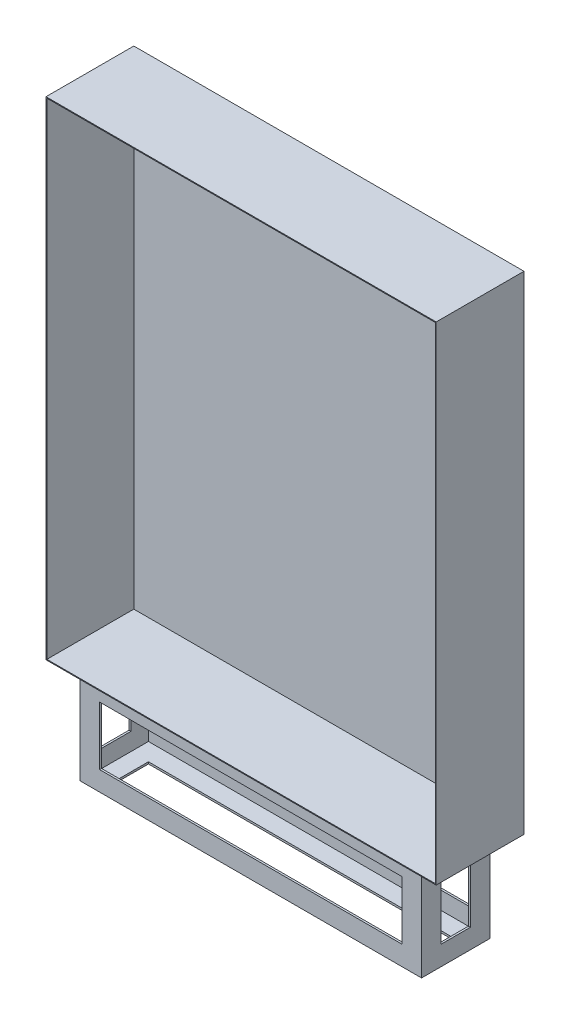
ISO-10303-21;
HEADER;
FILE_DESCRIPTION(('STEP AP214'),'2;1');
FILE_NAME('part.step','',(''),(''),'','','');
FILE_SCHEMA(('AUTOMOTIVE_DESIGN { 1 0 10303 214 1 1 1 1 }'));
ENDSEC;
DATA;
#1=APPLICATION_CONTEXT('core data for automotive mechanical design processes');
#2=APPLICATION_PROTOCOL_DEFINITION('international standard','automotive_design',2000,#1);
#3=PRODUCT_CONTEXT('',#1,'mechanical');
#4=PRODUCT('Part','Part','',(#3));
#5=PRODUCT_RELATED_PRODUCT_CATEGORY('part','',(#4));
#6=PRODUCT_DEFINITION_FORMATION('','',#4);
#7=PRODUCT_DEFINITION_CONTEXT('part definition',#1,'design');
#8=PRODUCT_DEFINITION('design','',#6,#7);
#9=PRODUCT_DEFINITION_SHAPE('','',#8);
#10=(LENGTH_UNIT() NAMED_UNIT(*) SI_UNIT(.MILLI.,.METRE.));
#11=(NAMED_UNIT(*) PLANE_ANGLE_UNIT() SI_UNIT($,.RADIAN.));
#12=(NAMED_UNIT(*) SI_UNIT($,.STERADIAN.) SOLID_ANGLE_UNIT());
#13=UNCERTAINTY_MEASURE_WITH_UNIT(LENGTH_MEASURE(1.E-05),#10,'distance_accuracy_value','');
#14=(GEOMETRIC_REPRESENTATION_CONTEXT(3) GLOBAL_UNCERTAINTY_ASSIGNED_CONTEXT((#13)) GLOBAL_UNIT_ASSIGNED_CONTEXT((#10,
#11,#12)) REPRESENTATION_CONTEXT('',''));
#15=CARTESIAN_POINT('',(0.,0.,0.));
#16=DIRECTION('',(0.,0.,1.));
#17=DIRECTION('',(1.,0.,0.));
#18=AXIS2_PLACEMENT_3D('',#15,#16,#17);
#19=CARTESIAN_POINT('',(0.,0.,180.));
#20=DIRECTION('',(0.,1.,0.));
#21=DIRECTION('',(0.,0.,1.));
#22=AXIS2_PLACEMENT_3D('',#19,#20,#21);
#23=PLANE('',#22);
#24=DIRECTION('',(1.,0.,0.));
#25=VECTOR('',#24,1.);
#26=CARTESIAN_POINT('',(0.,0.,0.));
#27=LINE('',#26,#25);
#28=CARTESIAN_POINT('',(0.,0.,0.));
#29=VERTEX_POINT('',#28);
#30=CARTESIAN_POINT('',(800.,0.,0.));
#31=VERTEX_POINT('',#30);
#32=EDGE_CURVE('E493',#29,#31,#27,.T.);
#33=ORIENTED_EDGE('',*,*,#32,.T.);
#34=DIRECTION('',(0.,0.,-1.));
#35=VECTOR('',#34,1.);
#36=CARTESIAN_POINT('',(800.,0.,180.));
#37=LINE('',#36,#35);
#38=CARTESIAN_POINT('',(800.,0.,180.));
#39=VERTEX_POINT('',#38);
#40=EDGE_CURVE('E503',#39,#31,#37,.T.);
#41=ORIENTED_EDGE('',*,*,#40,.F.);
#42=DIRECTION('',(1.,0.,0.));
#43=VECTOR('',#42,1.);
#44=CARTESIAN_POINT('',(0.,0.,180.));
#45=LINE('',#44,#43);
#46=CARTESIAN_POINT('',(0.,0.,180.));
#47=VERTEX_POINT('',#46);
#48=EDGE_CURVE('E483',#47,#39,#45,.T.);
#49=ORIENTED_EDGE('',*,*,#48,.F.);
#50=DIRECTION('',(0.,0.,-1.));
#51=VECTOR('',#50,1.);
#52=CARTESIAN_POINT('',(0.,0.,180.));
#53=LINE('',#52,#51);
#54=EDGE_CURVE('E506',#47,#29,#53,.T.);
#55=ORIENTED_EDGE('',*,*,#54,.T.);
#56=EDGE_LOOP('',(#33,#41,#49,#55));
#57=FACE_BOUND('',#56,.T.);
#58=DIRECTION('',(0.,0.,-1.));
#59=VECTOR('',#58,1.);
#60=CARTESIAN_POINT('',(50.,0.,160.));
#61=LINE('',#60,#59);
#62=CARTESIAN_POINT('',(50.,0.,160.));
#63=VERTEX_POINT('',#62);
#64=CARTESIAN_POINT('',(50.,0.,20.));
#65=VERTEX_POINT('',#64);
#66=EDGE_CURVE('E420',#63,#65,#61,.T.);
#67=ORIENTED_EDGE('',*,*,#66,.F.);
#68=DIRECTION('',(-1.,0.,0.));
#69=VECTOR('',#68,1.);
#70=CARTESIAN_POINT('',(50.,0.,160.));
#71=LINE('',#70,#69);
#72=CARTESIAN_POINT('',(750.,0.,160.));
#73=VERTEX_POINT('',#72);
#74=EDGE_CURVE('E425',#73,#63,#71,.T.);
#75=ORIENTED_EDGE('',*,*,#74,.F.);
#76=DIRECTION('',(0.,0.,1.));
#77=VECTOR('',#76,1.);
#78=CARTESIAN_POINT('',(750.,0.,160.));
#79=LINE('',#78,#77);
#80=CARTESIAN_POINT('',(750.,0.,20.));
#81=VERTEX_POINT('',#80);
#82=EDGE_CURVE('E437',#81,#73,#79,.T.);
#83=ORIENTED_EDGE('',*,*,#82,.F.);
#84=DIRECTION('',(1.,0.,0.));
#85=VECTOR('',#84,1.);
#86=CARTESIAN_POINT('',(50.,0.,20.));
#87=LINE('',#86,#85);
#88=EDGE_CURVE('E434',#65,#81,#87,.T.);
#89=ORIENTED_EDGE('',*,*,#88,.F.);
#90=EDGE_LOOP('',(#67,#75,#83,#89));
#91=FACE_BOUND('',#90,.T.);
#92=ADVANCED_FACE('F34',(#57,#91),#23,.F.);
#93=CARTESIAN_POINT('',(0.,0.,180.));
#94=DIRECTION('',(0.,0.,-1.));
#95=DIRECTION('',(-1.,0.,0.));
#96=AXIS2_PLACEMENT_3D('',#93,#94,#95);
#97=PLANE('',#96);
#98=DIRECTION('',(0.,-1.,0.));
#99=VECTOR('',#98,1.);
#100=CARTESIAN_POINT('',(0.,0.,180.));
#101=LINE('',#100,#99);
#102=CARTESIAN_POINT('',(0.,1000.,180.));
#103=VERTEX_POINT('',#102);
#104=EDGE_CURVE('E480',#103,#47,#101,.T.);
#105=ORIENTED_EDGE('',*,*,#104,.T.);
#106=ORIENTED_EDGE('',*,*,#48,.T.);
#107=DIRECTION('',(0.,1.,0.));
#108=VECTOR('',#107,1.);
#109=CARTESIAN_POINT('',(800.,0.,180.));
#110=LINE('',#109,#108);
#111=CARTESIAN_POINT('',(800.,1000.,180.));
#112=VERTEX_POINT('',#111);
#113=EDGE_CURVE('E486',#39,#112,#110,.T.);
#114=ORIENTED_EDGE('',*,*,#113,.T.);
#115=DIRECTION('',(-1.,0.,0.));
#116=VECTOR('',#115,1.);
#117=CARTESIAN_POINT('',(0.,1000.,180.));
#118=LINE('',#117,#116);
#119=EDGE_CURVE('E488',#112,#103,#118,.T.);
#120=ORIENTED_EDGE('',*,*,#119,.T.);
#121=EDGE_LOOP('',(#105,#106,#114,#120));
#122=FACE_BOUND('',#121,.T.);
#123=DIRECTION('',(0.,-1.,0.));
#124=VECTOR('',#123,1.);
#125=CARTESIAN_POINT('',(1.8,0.,180.));
#126=LINE('',#125,#124);
#127=CARTESIAN_POINT('',(1.8,998.2,180.));
#128=VERTEX_POINT('',#127);
#129=CARTESIAN_POINT('',(1.8,1.8,180.));
#130=VERTEX_POINT('',#129);
#131=EDGE_CURVE('E472',#128,#130,#126,.T.);
#132=ORIENTED_EDGE('',*,*,#131,.F.);
#133=DIRECTION('',(-1.,0.,0.));
#134=VECTOR('',#133,1.);
#135=CARTESIAN_POINT('',(0.,998.2,180.));
#136=LINE('',#135,#134);
#137=CARTESIAN_POINT('',(798.2,998.2,180.));
#138=VERTEX_POINT('',#137);
#139=EDGE_CURVE('E462',#138,#128,#136,.T.);
#140=ORIENTED_EDGE('',*,*,#139,.F.);
#141=DIRECTION('',(0.,1.,0.));
#142=VECTOR('',#141,1.);
#143=CARTESIAN_POINT('',(798.2,0.,180.));
#144=LINE('',#143,#142);
#145=CARTESIAN_POINT('',(798.2,1.8,180.));
#146=VERTEX_POINT('',#145);
#147=EDGE_CURVE('E476',#146,#138,#144,.T.);
#148=ORIENTED_EDGE('',*,*,#147,.F.);
#149=DIRECTION('',(1.,0.,0.));
#150=VECTOR('',#149,1.);
#151=CARTESIAN_POINT('',(0.,1.8,180.));
#152=LINE('',#151,#150);
#153=EDGE_CURVE('E474',#130,#146,#152,.T.);
#154=ORIENTED_EDGE('',*,*,#153,.F.);
#155=EDGE_LOOP('',(#132,#140,#148,#154));
#156=FACE_BOUND('',#155,.T.);
#157=ADVANCED_FACE('F604',(#122,#156),#97,.F.);
#158=CARTESIAN_POINT('',(0.,0.,180.));
#159=DIRECTION('',(1.,0.,0.));
#160=DIRECTION('',(0.,0.,-1.));
#161=AXIS2_PLACEMENT_3D('',#158,#159,#160);
#162=PLANE('',#161);
#163=DIRECTION('',(0.,-1.,0.));
#164=VECTOR('',#163,1.);
#165=CARTESIAN_POINT('',(0.,0.,0.));
#166=LINE('',#165,#164);
#167=CARTESIAN_POINT('',(0.,1000.,0.));
#168=VERTEX_POINT('',#167);
#169=EDGE_CURVE('E456',#168,#29,#166,.T.);
#170=ORIENTED_EDGE('',*,*,#169,.T.);
#171=ORIENTED_EDGE('',*,*,#54,.F.);
#172=ORIENTED_EDGE('',*,*,#104,.F.);
#173=DIRECTION('',(0.,0.,-1.));
#174=VECTOR('',#173,1.);
#175=CARTESIAN_POINT('',(0.,1000.,180.));
#176=LINE('',#175,#174);
#177=EDGE_CURVE('E490',#103,#168,#176,.T.);
#178=ORIENTED_EDGE('',*,*,#177,.T.);
#179=EDGE_LOOP('',(#170,#171,#172,#178));
#180=FACE_BOUND('',#179,.T.);
#181=ADVANCED_FACE('F36',(#180),#162,.F.);
#182=CARTESIAN_POINT('',(800.,0.,180.));
#183=DIRECTION('',(-1.,0.,0.));
#184=DIRECTION('',(0.,0.,1.));
#185=AXIS2_PLACEMENT_3D('',#182,#183,#184);
#186=PLANE('',#185);
#187=DIRECTION('',(0.,1.,0.));
#188=VECTOR('',#187,1.);
#189=CARTESIAN_POINT('',(800.,0.,0.));
#190=LINE('',#189,#188);
#191=CARTESIAN_POINT('',(800.,1000.,0.));
#192=VERTEX_POINT('',#191);
#193=EDGE_CURVE('E495',#31,#192,#190,.T.);
#194=ORIENTED_EDGE('',*,*,#193,.T.);
#195=DIRECTION('',(0.,0.,-1.));
#196=VECTOR('',#195,1.);
#197=CARTESIAN_POINT('',(800.,1000.,180.));
#198=LINE('',#197,#196);
#199=EDGE_CURVE('E500',#112,#192,#198,.T.);
#200=ORIENTED_EDGE('',*,*,#199,.F.);
#201=ORIENTED_EDGE('',*,*,#113,.F.);
#202=ORIENTED_EDGE('',*,*,#40,.T.);
#203=EDGE_LOOP('',(#194,#200,#201,#202));
#204=FACE_BOUND('',#203,.T.);
#205=ADVANCED_FACE('F683',(#204),#186,.F.);
#206=CARTESIAN_POINT('',(0.,1000.,180.));
#207=DIRECTION('',(0.,-1.,0.));
#208=DIRECTION('',(0.,0.,-1.));
#209=AXIS2_PLACEMENT_3D('',#206,#207,#208);
#210=PLANE('',#209);
#211=DIRECTION('',(-1.,0.,0.));
#212=VECTOR('',#211,1.);
#213=CARTESIAN_POINT('',(0.,1000.,0.));
#214=LINE('',#213,#212);
#215=EDGE_CURVE('E484',#192,#168,#214,.T.);
#216=ORIENTED_EDGE('',*,*,#215,.T.);
#217=ORIENTED_EDGE('',*,*,#177,.F.);
#218=ORIENTED_EDGE('',*,*,#119,.F.);
#219=ORIENTED_EDGE('',*,*,#199,.T.);
#220=EDGE_LOOP('',(#216,#217,#218,#219));
#221=FACE_BOUND('',#220,.T.);
#222=ADVANCED_FACE('F680',(#221),#210,.F.);
#223=CARTESIAN_POINT('',(0.,0.,0.));
#224=DIRECTION('',(0.,0.,-1.));
#225=DIRECTION('',(-1.,0.,0.));
#226=AXIS2_PLACEMENT_3D('',#223,#224,#225);
#227=PLANE('',#226);
#228=ORIENTED_EDGE('',*,*,#169,.F.);
#229=ORIENTED_EDGE('',*,*,#215,.F.);
#230=ORIENTED_EDGE('',*,*,#193,.F.);
#231=ORIENTED_EDGE('',*,*,#32,.F.);
#232=EDGE_LOOP('',(#228,#229,#230,#231));
#233=FACE_BOUND('',#232,.T.);
#234=ADVANCED_FACE('F662',(#233),#227,.T.);
#235=CARTESIAN_POINT('',(1.8,0.,180.));
#236=DIRECTION('',(1.,0.,0.));
#237=DIRECTION('',(0.,0.,-1.));
#238=AXIS2_PLACEMENT_3D('',#235,#236,#237);
#239=PLANE('',#238);
#240=DIRECTION('',(0.,-1.,0.));
#241=VECTOR('',#240,1.);
#242=CARTESIAN_POINT('',(1.8,0.,1.8));
#243=LINE('',#242,#241);
#244=CARTESIAN_POINT('',(1.8,998.2,1.8));
#245=VERTEX_POINT('',#244);
#246=CARTESIAN_POINT('',(1.8,1.8,1.8));
#247=VERTEX_POINT('',#246);
#248=EDGE_CURVE('E449',#245,#247,#243,.T.);
#249=ORIENTED_EDGE('',*,*,#248,.F.);
#250=DIRECTION('',(0.,0.,-1.));
#251=VECTOR('',#250,1.);
#252=CARTESIAN_POINT('',(1.8,998.2,180.));
#253=LINE('',#252,#251);
#254=EDGE_CURVE('E458',#128,#245,#253,.T.);
#255=ORIENTED_EDGE('',*,*,#254,.F.);
#256=ORIENTED_EDGE('',*,*,#131,.T.);
#257=DIRECTION('',(0.,0.,-1.));
#258=VECTOR('',#257,1.);
#259=CARTESIAN_POINT('',(1.8,1.8,180.));
#260=LINE('',#259,#258);
#261=EDGE_CURVE('E453',#130,#247,#260,.T.);
#262=ORIENTED_EDGE('',*,*,#261,.T.);
#263=EDGE_LOOP('',(#249,#255,#256,#262));
#264=FACE_BOUND('',#263,.T.);
#265=ADVANCED_FACE('F658',(#264),#239,.T.);
#266=CARTESIAN_POINT('',(0.,1.8,180.));
#267=DIRECTION('',(0.,1.,0.));
#268=DIRECTION('',(0.,0.,1.));
#269=AXIS2_PLACEMENT_3D('',#266,#267,#268);
#270=PLANE('',#269);
#271=DIRECTION('',(1.,0.,0.));
#272=VECTOR('',#271,1.);
#273=CARTESIAN_POINT('',(0.,1.8,1.8));
#274=LINE('',#273,#272);
#275=CARTESIAN_POINT('',(798.2,1.8,1.8));
#276=VERTEX_POINT('',#275);
#277=EDGE_CURVE('E452',#247,#276,#274,.T.);
#278=ORIENTED_EDGE('',*,*,#277,.F.);
#279=ORIENTED_EDGE('',*,*,#261,.F.);
#280=ORIENTED_EDGE('',*,*,#153,.T.);
#281=DIRECTION('',(0.,0.,-1.));
#282=VECTOR('',#281,1.);
#283=CARTESIAN_POINT('',(798.2,1.8,180.));
#284=LINE('',#283,#282);
#285=EDGE_CURVE('E457',#146,#276,#284,.T.);
#286=ORIENTED_EDGE('',*,*,#285,.T.);
#287=EDGE_LOOP('',(#278,#279,#280,#286));
#288=FACE_BOUND('',#287,.T.);
#289=ADVANCED_FACE('F661',(#288),#270,.T.);
#290=CARTESIAN_POINT('',(798.2,0.,180.));
#291=DIRECTION('',(-1.,0.,0.));
#292=DIRECTION('',(0.,0.,1.));
#293=AXIS2_PLACEMENT_3D('',#290,#291,#292);
#294=PLANE('',#293);
#295=DIRECTION('',(0.,1.,0.));
#296=VECTOR('',#295,1.);
#297=CARTESIAN_POINT('',(798.2,0.,1.8));
#298=LINE('',#297,#296);
#299=CARTESIAN_POINT('',(798.2,998.2,1.8));
#300=VERTEX_POINT('',#299);
#301=EDGE_CURVE('E464',#276,#300,#298,.T.);
#302=ORIENTED_EDGE('',*,*,#301,.F.);
#303=ORIENTED_EDGE('',*,*,#285,.F.);
#304=ORIENTED_EDGE('',*,*,#147,.T.);
#305=DIRECTION('',(0.,0.,-1.));
#306=VECTOR('',#305,1.);
#307=CARTESIAN_POINT('',(798.2,998.2,180.));
#308=LINE('',#307,#306);
#309=EDGE_CURVE('E461',#138,#300,#308,.T.);
#310=ORIENTED_EDGE('',*,*,#309,.T.);
#311=EDGE_LOOP('',(#302,#303,#304,#310));
#312=FACE_BOUND('',#311,.T.);
#313=ADVANCED_FACE('F666',(#312),#294,.T.);
#314=CARTESIAN_POINT('',(0.,998.2,180.));
#315=DIRECTION('',(0.,-1.,0.));
#316=DIRECTION('',(0.,0.,-1.));
#317=AXIS2_PLACEMENT_3D('',#314,#315,#316);
#318=PLANE('',#317);
#319=DIRECTION('',(-1.,0.,0.));
#320=VECTOR('',#319,1.);
#321=CARTESIAN_POINT('',(0.,998.2,1.8));
#322=LINE('',#321,#320);
#323=EDGE_CURVE('E468',#300,#245,#322,.T.);
#324=ORIENTED_EDGE('',*,*,#323,.F.);
#325=ORIENTED_EDGE('',*,*,#309,.F.);
#326=ORIENTED_EDGE('',*,*,#139,.T.);
#327=ORIENTED_EDGE('',*,*,#254,.T.);
#328=EDGE_LOOP('',(#324,#325,#326,#327));
#329=FACE_BOUND('',#328,.T.);
#330=ADVANCED_FACE('F670',(#329),#318,.T.);
#331=CARTESIAN_POINT('',(0.,0.,1.8));
#332=DIRECTION('',(0.,0.,-1.));
#333=DIRECTION('',(-1.,0.,0.));
#334=AXIS2_PLACEMENT_3D('',#331,#332,#333);
#335=PLANE('',#334);
#336=ORIENTED_EDGE('',*,*,#248,.T.);
#337=ORIENTED_EDGE('',*,*,#277,.T.);
#338=ORIENTED_EDGE('',*,*,#301,.T.);
#339=ORIENTED_EDGE('',*,*,#323,.T.);
#340=EDGE_LOOP('',(#336,#337,#338,#339));
#341=FACE_BOUND('',#340,.T.);
#342=ADVANCED_FACE('F574',(#341),#335,.F.);
#343=CARTESIAN_POINT('',(0.,-200.,0.));
#344=DIRECTION('',(0.,-1.,0.));
#345=DIRECTION('',(0.,0.,-1.));
#346=AXIS2_PLACEMENT_3D('',#343,#344,#345);
#347=PLANE('',#346);
#348=DIRECTION('',(0.,0.,-1.));
#349=VECTOR('',#348,1.);
#350=CARTESIAN_POINT('',(50.,-200.,160.));
#351=LINE('',#350,#349);
#352=CARTESIAN_POINT('',(50.,-200.,160.));
#353=VERTEX_POINT('',#352);
#354=CARTESIAN_POINT('',(50.,-200.,20.));
#355=VERTEX_POINT('',#354);
#356=EDGE_CURVE('E421',#353,#355,#351,.T.);
#357=ORIENTED_EDGE('',*,*,#356,.T.);
#358=DIRECTION('',(1.,0.,0.));
#359=VECTOR('',#358,1.);
#360=CARTESIAN_POINT('',(50.,-200.,20.));
#361=LINE('',#360,#359);
#362=CARTESIAN_POINT('',(750.,-200.,20.));
#363=VERTEX_POINT('',#362);
#364=EDGE_CURVE('E424',#355,#363,#361,.T.);
#365=ORIENTED_EDGE('',*,*,#364,.T.);
#366=DIRECTION('',(0.,0.,1.));
#367=VECTOR('',#366,1.);
#368=CARTESIAN_POINT('',(750.,-200.,160.));
#369=LINE('',#368,#367);
#370=CARTESIAN_POINT('',(750.,-200.,160.));
#371=VERTEX_POINT('',#370);
#372=EDGE_CURVE('E427',#363,#371,#369,.T.);
#373=ORIENTED_EDGE('',*,*,#372,.T.);
#374=DIRECTION('',(-1.,0.,0.));
#375=VECTOR('',#374,1.);
#376=CARTESIAN_POINT('',(50.,-200.,160.));
#377=LINE('',#376,#375);
#378=EDGE_CURVE('E429',#371,#353,#377,.T.);
#379=ORIENTED_EDGE('',*,*,#378,.T.);
#380=EDGE_LOOP('',(#357,#365,#373,#379));
#381=FACE_BOUND('',#380,.T.);
#382=DIRECTION('',(-1.,0.,0.));
#383=VECTOR('',#382,1.);
#384=CARTESIAN_POINT('',(710.,-200.,120.));
#385=LINE('',#384,#383);
#386=CARTESIAN_POINT('',(710.,-200.,120.));
#387=VERTEX_POINT('',#386);
#388=CARTESIAN_POINT('',(90.,-200.,120.));
#389=VERTEX_POINT('',#388);
#390=EDGE_CURVE('E359',#387,#389,#385,.T.);
#391=ORIENTED_EDGE('',*,*,#390,.F.);
#392=DIRECTION('',(0.,0.,1.));
#393=VECTOR('',#392,1.);
#394=CARTESIAN_POINT('',(710.,-200.,60.));
#395=LINE('',#394,#393);
#396=CARTESIAN_POINT('',(710.,-200.,60.));
#397=VERTEX_POINT('',#396);
#398=EDGE_CURVE('E364',#397,#387,#395,.T.);
#399=ORIENTED_EDGE('',*,*,#398,.F.);
#400=DIRECTION('',(1.,0.,0.));
#401=VECTOR('',#400,1.);
#402=CARTESIAN_POINT('',(90.,-200.,60.));
#403=LINE('',#402,#401);
#404=CARTESIAN_POINT('',(90.,-200.,60.));
#405=VERTEX_POINT('',#404);
#406=EDGE_CURVE('E378',#405,#397,#403,.T.);
#407=ORIENTED_EDGE('',*,*,#406,.F.);
#408=DIRECTION('',(0.,0.,-1.));
#409=VECTOR('',#408,1.);
#410=CARTESIAN_POINT('',(90.,-200.,120.));
#411=LINE('',#410,#409);
#412=EDGE_CURVE('E375',#389,#405,#411,.T.);
#413=ORIENTED_EDGE('',*,*,#412,.F.);
#414=EDGE_LOOP('',(#391,#399,#407,#413));
#415=FACE_BOUND('',#414,.T.);
#416=ADVANCED_FACE('F554',(#381,#415),#347,.T.);
#417=CARTESIAN_POINT('',(50.,-200.,160.));
#418=DIRECTION('',(1.,0.,0.));
#419=DIRECTION('',(0.,0.,-1.));
#420=AXIS2_PLACEMENT_3D('',#417,#418,#419);
#421=PLANE('',#420);
#422=DIRECTION('',(0.,1.,0.));
#423=VECTOR('',#422,1.);
#424=CARTESIAN_POINT('',(50.,-40.,120.));
#425=LINE('',#424,#423);
#426=CARTESIAN_POINT('',(50.,-160.,120.));
#427=VERTEX_POINT('',#426);
#428=CARTESIAN_POINT('',(50.,-40.,120.));
#429=VERTEX_POINT('',#428);
#430=EDGE_CURVE('E546',#427,#429,#425,.T.);
#431=ORIENTED_EDGE('',*,*,#430,.F.);
#432=DIRECTION('',(0.,0.,1.));
#433=VECTOR('',#432,1.);
#434=CARTESIAN_POINT('',(50.,-160.,120.));
#435=LINE('',#434,#433);
#436=CARTESIAN_POINT('',(50.,-160.,60.));
#437=VERTEX_POINT('',#436);
#438=EDGE_CURVE('E308',#437,#427,#435,.T.);
#439=ORIENTED_EDGE('',*,*,#438,.F.);
#440=DIRECTION('',(0.,-1.,0.));
#441=VECTOR('',#440,1.);
#442=CARTESIAN_POINT('',(50.,-160.,60.));
#443=LINE('',#442,#441);
#444=CARTESIAN_POINT('',(50.,-40.,60.));
#445=VERTEX_POINT('',#444);
#446=EDGE_CURVE('E305',#445,#437,#443,.T.);
#447=ORIENTED_EDGE('',*,*,#446,.F.);
#448=DIRECTION('',(0.,0.,-1.));
#449=VECTOR('',#448,1.);
#450=CARTESIAN_POINT('',(50.,-40.,60.));
#451=LINE('',#450,#449);
#452=EDGE_CURVE('E298',#429,#445,#451,.T.);
#453=ORIENTED_EDGE('',*,*,#452,.F.);
#454=EDGE_LOOP('',(#431,#439,#447,#453));
#455=FACE_BOUND('',#454,.T.);
#456=DIRECTION('',(0.,1.,0.));
#457=VECTOR('',#456,1.);
#458=CARTESIAN_POINT('',(50.,-200.,160.));
#459=LINE('',#458,#457);
#460=EDGE_CURVE('E431',#353,#63,#459,.T.);
#461=ORIENTED_EDGE('',*,*,#460,.T.);
#462=ORIENTED_EDGE('',*,*,#66,.T.);
#463=DIRECTION('',(0.,1.,0.));
#464=VECTOR('',#463,1.);
#465=CARTESIAN_POINT('',(50.,-200.,20.));
#466=LINE('',#465,#464);
#467=EDGE_CURVE('E447',#355,#65,#466,.T.);
#468=ORIENTED_EDGE('',*,*,#467,.F.);
#469=ORIENTED_EDGE('',*,*,#356,.F.);
#470=EDGE_LOOP('',(#461,#462,#468,#469));
#471=FACE_BOUND('',#470,.T.);
#472=ADVANCED_FACE('F548',(#455,#471),#421,.F.);
#473=CARTESIAN_POINT('',(50.,-200.,20.));
#474=DIRECTION('',(0.,0.,1.));
#475=DIRECTION('',(1.,0.,0.));
#476=AXIS2_PLACEMENT_3D('',#473,#474,#475);
#477=PLANE('',#476);
#478=DIRECTION('',(0.,1.,0.));
#479=VECTOR('',#478,1.);
#480=CARTESIAN_POINT('',(90.,-160.,20.));
#481=LINE('',#480,#479);
#482=CARTESIAN_POINT('',(90.,-160.,20.));
#483=VERTEX_POINT('',#482);
#484=CARTESIAN_POINT('',(90.,-40.,20.));
#485=VERTEX_POINT('',#484);
#486=EDGE_CURVE('E326',#483,#485,#481,.T.);
#487=ORIENTED_EDGE('',*,*,#486,.F.);
#488=DIRECTION('',(-1.,0.,0.));
#489=VECTOR('',#488,1.);
#490=CARTESIAN_POINT('',(710.,-160.,20.));
#491=LINE('',#490,#489);
#492=CARTESIAN_POINT('',(710.,-160.,20.));
#493=VERTEX_POINT('',#492);
#494=EDGE_CURVE('E315',#493,#483,#491,.T.);
#495=ORIENTED_EDGE('',*,*,#494,.F.);
#496=DIRECTION('',(0.,-1.,0.));
#497=VECTOR('',#496,1.);
#498=CARTESIAN_POINT('',(710.,-40.,20.));
#499=LINE('',#498,#497);
#500=CARTESIAN_POINT('',(710.,-40.,20.));
#501=VERTEX_POINT('',#500);
#502=EDGE_CURVE('E332',#501,#493,#499,.T.);
#503=ORIENTED_EDGE('',*,*,#502,.F.);
#504=DIRECTION('',(1.,0.,0.));
#505=VECTOR('',#504,1.);
#506=CARTESIAN_POINT('',(90.,-40.,20.));
#507=LINE('',#506,#505);
#508=EDGE_CURVE('E329',#485,#501,#507,.T.);
#509=ORIENTED_EDGE('',*,*,#508,.F.);
#510=EDGE_LOOP('',(#487,#495,#503,#509));
#511=FACE_BOUND('',#510,.T.);
#512=ORIENTED_EDGE('',*,*,#467,.T.);
#513=ORIENTED_EDGE('',*,*,#88,.T.);
#514=DIRECTION('',(0.,1.,0.));
#515=VECTOR('',#514,1.);
#516=CARTESIAN_POINT('',(750.,-200.,20.));
#517=LINE('',#516,#515);
#518=EDGE_CURVE('E445',#363,#81,#517,.T.);
#519=ORIENTED_EDGE('',*,*,#518,.F.);
#520=ORIENTED_EDGE('',*,*,#364,.F.);
#521=EDGE_LOOP('',(#512,#513,#519,#520));
#522=FACE_BOUND('',#521,.T.);
#523=ADVANCED_FACE('F553',(#511,#522),#477,.F.);
#524=CARTESIAN_POINT('',(750.,-200.,160.));
#525=DIRECTION('',(-1.,0.,0.));
#526=DIRECTION('',(0.,0.,1.));
#527=AXIS2_PLACEMENT_3D('',#524,#525,#526);
#528=PLANE('',#527);
#529=DIRECTION('',(0.,1.,0.));
#530=VECTOR('',#529,1.);
#531=CARTESIAN_POINT('',(750.,-160.,60.));
#532=LINE('',#531,#530);
#533=CARTESIAN_POINT('',(750.,-160.,60.));
#534=VERTEX_POINT('',#533);
#535=CARTESIAN_POINT('',(750.,-40.,60.));
#536=VERTEX_POINT('',#535);
#537=EDGE_CURVE('E282',#534,#536,#532,.T.);
#538=ORIENTED_EDGE('',*,*,#537,.F.);
#539=DIRECTION('',(0.,0.,-1.));
#540=VECTOR('',#539,1.);
#541=CARTESIAN_POINT('',(750.,-160.,120.));
#542=LINE('',#541,#540);
#543=CARTESIAN_POINT('',(750.,-160.,120.));
#544=VERTEX_POINT('',#543);
#545=EDGE_CURVE('E57',#544,#534,#542,.T.);
#546=ORIENTED_EDGE('',*,*,#545,.F.);
#547=DIRECTION('',(0.,-1.,0.));
#548=VECTOR('',#547,1.);
#549=CARTESIAN_POINT('',(750.,-40.,120.));
#550=LINE('',#549,#548);
#551=CARTESIAN_POINT('',(750.,-40.,120.));
#552=VERTEX_POINT('',#551);
#553=EDGE_CURVE('E290',#552,#544,#550,.T.);
#554=ORIENTED_EDGE('',*,*,#553,.F.);
#555=DIRECTION('',(0.,0.,1.));
#556=VECTOR('',#555,1.);
#557=CARTESIAN_POINT('',(750.,-40.,60.));
#558=LINE('',#557,#556);
#559=EDGE_CURVE('E273',#536,#552,#558,.T.);
#560=ORIENTED_EDGE('',*,*,#559,.F.);
#561=EDGE_LOOP('',(#538,#546,#554,#560));
#562=FACE_BOUND('',#561,.T.);
#563=ORIENTED_EDGE('',*,*,#518,.T.);
#564=ORIENTED_EDGE('',*,*,#82,.T.);
#565=DIRECTION('',(0.,1.,0.));
#566=VECTOR('',#565,1.);
#567=CARTESIAN_POINT('',(750.,-200.,160.));
#568=LINE('',#567,#566);
#569=EDGE_CURVE('E443',#371,#73,#568,.T.);
#570=ORIENTED_EDGE('',*,*,#569,.F.);
#571=ORIENTED_EDGE('',*,*,#372,.F.);
#572=EDGE_LOOP('',(#563,#564,#570,#571));
#573=FACE_BOUND('',#572,.T.);
#574=ADVANCED_FACE('F287',(#562,#573),#528,.F.);
#575=CARTESIAN_POINT('',(50.,-200.,160.));
#576=DIRECTION('',(0.,0.,-1.));
#577=DIRECTION('',(-1.,0.,0.));
#578=AXIS2_PLACEMENT_3D('',#575,#576,#577);
#579=PLANE('',#578);
#580=DIRECTION('',(0.,1.,0.));
#581=VECTOR('',#580,1.);
#582=CARTESIAN_POINT('',(710.,-40.,160.));
#583=LINE('',#582,#581);
#584=CARTESIAN_POINT('',(710.,-160.,160.));
#585=VERTEX_POINT('',#584);
#586=CARTESIAN_POINT('',(710.,-40.,160.));
#587=VERTEX_POINT('',#586);
#588=EDGE_CURVE('E319',#585,#587,#583,.T.);
#589=ORIENTED_EDGE('',*,*,#588,.F.);
#590=DIRECTION('',(1.,0.,0.));
#591=VECTOR('',#590,1.);
#592=CARTESIAN_POINT('',(710.,-160.,160.));
#593=LINE('',#592,#591);
#594=CARTESIAN_POINT('',(90.,-160.,160.));
#595=VERTEX_POINT('',#594);
#596=EDGE_CURVE('E322',#595,#585,#593,.T.);
#597=ORIENTED_EDGE('',*,*,#596,.F.);
#598=DIRECTION('',(0.,-1.,0.));
#599=VECTOR('',#598,1.);
#600=CARTESIAN_POINT('',(90.,-160.,160.));
#601=LINE('',#600,#599);
#602=CARTESIAN_POINT('',(90.,-40.,160.));
#603=VERTEX_POINT('',#602);
#604=EDGE_CURVE('E324',#603,#595,#601,.T.);
#605=ORIENTED_EDGE('',*,*,#604,.F.);
#606=DIRECTION('',(-1.,0.,0.));
#607=VECTOR('',#606,1.);
#608=CARTESIAN_POINT('',(90.,-40.,160.));
#609=LINE('',#608,#607);
#610=EDGE_CURVE('E316',#587,#603,#609,.T.);
#611=ORIENTED_EDGE('',*,*,#610,.F.);
#612=EDGE_LOOP('',(#589,#597,#605,#611));
#613=FACE_BOUND('',#612,.T.);
#614=ORIENTED_EDGE('',*,*,#569,.T.);
#615=ORIENTED_EDGE('',*,*,#74,.T.);
#616=ORIENTED_EDGE('',*,*,#460,.F.);
#617=ORIENTED_EDGE('',*,*,#378,.F.);
#618=EDGE_LOOP('',(#614,#615,#616,#617));
#619=FACE_BOUND('',#618,.T.);
#620=ADVANCED_FACE('F566',(#613,#619),#579,.F.);
#621=CARTESIAN_POINT('',(0.,-196.,0.));
#622=DIRECTION('',(0.,-1.,0.));
#623=DIRECTION('',(0.,0.,-1.));
#624=AXIS2_PLACEMENT_3D('',#621,#622,#623);
#625=PLANE('',#624);
#626=DIRECTION('',(-1.,0.,0.));
#627=VECTOR('',#626,1.);
#628=CARTESIAN_POINT('',(54.,-196.,156.));
#629=LINE('',#628,#627);
#630=CARTESIAN_POINT('',(746.,-196.,156.));
#631=VERTEX_POINT('',#630);
#632=CARTESIAN_POINT('',(54.,-196.,156.));
#633=VERTEX_POINT('',#632);
#634=EDGE_CURVE('E397',#631,#633,#629,.T.);
#635=ORIENTED_EDGE('',*,*,#634,.F.);
#636=DIRECTION('',(0.,0.,1.));
#637=VECTOR('',#636,1.);
#638=CARTESIAN_POINT('',(746.,-196.,156.));
#639=LINE('',#638,#637);
#640=CARTESIAN_POINT('',(746.,-196.,24.));
#641=VERTEX_POINT('',#640);
#642=EDGE_CURVE('E509',#641,#631,#639,.T.);
#643=ORIENTED_EDGE('',*,*,#642,.F.);
#644=DIRECTION('',(1.,0.,0.));
#645=VECTOR('',#644,1.);
#646=CARTESIAN_POINT('',(54.,-196.,24.));
#647=LINE('',#646,#645);
#648=CARTESIAN_POINT('',(54.,-196.,24.));
#649=VERTEX_POINT('',#648);
#650=EDGE_CURVE('E385',#649,#641,#647,.T.);
#651=ORIENTED_EDGE('',*,*,#650,.F.);
#652=DIRECTION('',(0.,0.,-1.));
#653=VECTOR('',#652,1.);
#654=CARTESIAN_POINT('',(54.,-196.,156.));
#655=LINE('',#654,#653);
#656=EDGE_CURVE('E394',#633,#649,#655,.T.);
#657=ORIENTED_EDGE('',*,*,#656,.F.);
#658=EDGE_LOOP('',(#635,#643,#651,#657));
#659=FACE_BOUND('',#658,.T.);
#660=DIRECTION('',(0.,0.,1.));
#661=VECTOR('',#660,1.);
#662=CARTESIAN_POINT('',(710.,-196.,60.));
#663=LINE('',#662,#661);
#664=CARTESIAN_POINT('',(710.,-196.,60.));
#665=VERTEX_POINT('',#664);
#666=CARTESIAN_POINT('',(710.,-196.,120.));
#667=VERTEX_POINT('',#666);
#668=EDGE_CURVE('E370',#665,#667,#663,.T.);
#669=ORIENTED_EDGE('',*,*,#668,.T.);
#670=DIRECTION('',(-1.,0.,0.));
#671=VECTOR('',#670,1.);
#672=CARTESIAN_POINT('',(710.,-196.,120.));
#673=LINE('',#672,#671);
#674=CARTESIAN_POINT('',(90.,-196.,120.));
#675=VERTEX_POINT('',#674);
#676=EDGE_CURVE('E360',#667,#675,#673,.T.);
#677=ORIENTED_EDGE('',*,*,#676,.T.);
#678=DIRECTION('',(0.,0.,-1.));
#679=VECTOR('',#678,1.);
#680=CARTESIAN_POINT('',(90.,-196.,120.));
#681=LINE('',#680,#679);
#682=CARTESIAN_POINT('',(90.,-196.,60.));
#683=VERTEX_POINT('',#682);
#684=EDGE_CURVE('E363',#675,#683,#681,.T.);
#685=ORIENTED_EDGE('',*,*,#684,.T.);
#686=DIRECTION('',(1.,0.,0.));
#687=VECTOR('',#686,1.);
#688=CARTESIAN_POINT('',(90.,-196.,60.));
#689=LINE('',#688,#687);
#690=EDGE_CURVE('E367',#683,#665,#689,.T.);
#691=ORIENTED_EDGE('',*,*,#690,.T.);
#692=EDGE_LOOP('',(#669,#677,#685,#691));
#693=FACE_BOUND('',#692,.T.);
#694=ADVANCED_FACE('F588',(#659,#693),#625,.F.);
#695=CARTESIAN_POINT('',(710.,-196.,120.));
#696=DIRECTION('',(0.,0.,1.));
#697=DIRECTION('',(1.,0.,0.));
#698=AXIS2_PLACEMENT_3D('',#695,#696,#697);
#699=PLANE('',#698);
#700=ORIENTED_EDGE('',*,*,#390,.T.);
#701=DIRECTION('',(0.,-1.,0.));
#702=VECTOR('',#701,1.);
#703=CARTESIAN_POINT('',(90.,-196.,120.));
#704=LINE('',#703,#702);
#705=EDGE_CURVE('E373',#675,#389,#704,.T.);
#706=ORIENTED_EDGE('',*,*,#705,.F.);
#707=ORIENTED_EDGE('',*,*,#676,.F.);
#708=DIRECTION('',(0.,-1.,0.));
#709=VECTOR('',#708,1.);
#710=CARTESIAN_POINT('',(710.,-196.,120.));
#711=LINE('',#710,#709);
#712=EDGE_CURVE('E383',#667,#387,#711,.T.);
#713=ORIENTED_EDGE('',*,*,#712,.T.);
#714=EDGE_LOOP('',(#700,#706,#707,#713));
#715=FACE_BOUND('',#714,.T.);
#716=ADVANCED_FACE('F581',(#715),#699,.F.);
#717=CARTESIAN_POINT('',(710.,-196.,60.));
#718=DIRECTION('',(1.,0.,0.));
#719=DIRECTION('',(0.,0.,-1.));
#720=AXIS2_PLACEMENT_3D('',#717,#718,#719);
#721=PLANE('',#720);
#722=ORIENTED_EDGE('',*,*,#398,.T.);
#723=ORIENTED_EDGE('',*,*,#712,.F.);
#724=ORIENTED_EDGE('',*,*,#668,.F.);
#725=DIRECTION('',(0.,-1.,0.));
#726=VECTOR('',#725,1.);
#727=CARTESIAN_POINT('',(710.,-196.,60.));
#728=LINE('',#727,#726);
#729=EDGE_CURVE('E386',#665,#397,#728,.T.);
#730=ORIENTED_EDGE('',*,*,#729,.T.);
#731=EDGE_LOOP('',(#722,#723,#724,#730));
#732=FACE_BOUND('',#731,.T.);
#733=ADVANCED_FACE('F591',(#732),#721,.F.);
#734=CARTESIAN_POINT('',(90.,-196.,60.));
#735=DIRECTION('',(0.,0.,-1.));
#736=DIRECTION('',(-1.,0.,0.));
#737=AXIS2_PLACEMENT_3D('',#734,#735,#736);
#738=PLANE('',#737);
#739=ORIENTED_EDGE('',*,*,#406,.T.);
#740=ORIENTED_EDGE('',*,*,#729,.F.);
#741=ORIENTED_EDGE('',*,*,#690,.F.);
#742=DIRECTION('',(0.,-1.,0.));
#743=VECTOR('',#742,1.);
#744=CARTESIAN_POINT('',(90.,-196.,60.));
#745=LINE('',#744,#743);
#746=EDGE_CURVE('E388',#683,#405,#745,.T.);
#747=ORIENTED_EDGE('',*,*,#746,.T.);
#748=EDGE_LOOP('',(#739,#740,#741,#747));
#749=FACE_BOUND('',#748,.T.);
#750=ADVANCED_FACE('F593',(#749),#738,.F.);
#751=CARTESIAN_POINT('',(90.,-196.,120.));
#752=DIRECTION('',(-1.,0.,0.));
#753=DIRECTION('',(0.,0.,1.));
#754=AXIS2_PLACEMENT_3D('',#751,#752,#753);
#755=PLANE('',#754);
#756=ORIENTED_EDGE('',*,*,#412,.T.);
#757=ORIENTED_EDGE('',*,*,#746,.F.);
#758=ORIENTED_EDGE('',*,*,#684,.F.);
#759=ORIENTED_EDGE('',*,*,#705,.T.);
#760=EDGE_LOOP('',(#756,#757,#758,#759));
#761=FACE_BOUND('',#760,.T.);
#762=ADVANCED_FACE('F585',(#761),#755,.F.);
#763=DIRECTION('',(0.,0.,1.));
#764=VECTOR('',#763,1.);
#765=CARTESIAN_POINT('',(746.,0.,156.));
#766=LINE('',#765,#764);
#767=CARTESIAN_POINT('',(746.,0.,24.));
#768=VERTEX_POINT('',#767);
#769=CARTESIAN_POINT('',(746.,0.,156.));
#770=VERTEX_POINT('',#769);
#771=EDGE_CURVE('E409',#768,#770,#766,.T.);
#772=ORIENTED_EDGE('',*,*,#771,.T.);
#773=DIRECTION('',(-1.,0.,0.));
#774=VECTOR('',#773,1.);
#775=CARTESIAN_POINT('',(54.,0.,156.));
#776=LINE('',#775,#774);
#777=CARTESIAN_POINT('',(54.,0.,156.));
#778=VERTEX_POINT('',#777);
#779=EDGE_CURVE('E400',#770,#778,#776,.T.);
#780=ORIENTED_EDGE('',*,*,#779,.T.);
#781=DIRECTION('',(0.,0.,-1.));
#782=VECTOR('',#781,1.);
#783=CARTESIAN_POINT('',(54.,0.,156.));
#784=LINE('',#783,#782);
#785=CARTESIAN_POINT('',(54.,0.,24.));
#786=VERTEX_POINT('',#785);
#787=EDGE_CURVE('E403',#778,#786,#784,.T.);
#788=ORIENTED_EDGE('',*,*,#787,.T.);
#789=DIRECTION('',(1.,0.,0.));
#790=VECTOR('',#789,1.);
#791=CARTESIAN_POINT('',(54.,0.,24.));
#792=LINE('',#791,#790);
#793=EDGE_CURVE('E406',#786,#768,#792,.T.);
#794=ORIENTED_EDGE('',*,*,#793,.T.);
#795=EDGE_LOOP('',(#772,#780,#788,#794));
#796=FACE_BOUND('',#795,.T.);
#797=ADVANCED_FACE('F600',(#796),#23,.F.);
#798=CARTESIAN_POINT('',(746.,-200.,156.));
#799=DIRECTION('',(-1.,0.,0.));
#800=DIRECTION('',(0.,0.,1.));
#801=AXIS2_PLACEMENT_3D('',#798,#799,#800);
#802=PLANE('',#801);
#803=DIRECTION('',(0.,0.,1.));
#804=VECTOR('',#803,1.);
#805=CARTESIAN_POINT('',(746.,-160.,156.));
#806=LINE('',#805,#804);
#807=CARTESIAN_POINT('',(746.,-160.,60.));
#808=VERTEX_POINT('',#807);
#809=CARTESIAN_POINT('',(746.,-160.,120.));
#810=VERTEX_POINT('',#809);
#811=EDGE_CURVE('E313',#808,#810,#806,.T.);
#812=ORIENTED_EDGE('',*,*,#811,.F.);
#813=DIRECTION('',(0.,-1.,0.));
#814=VECTOR('',#813,1.);
#815=CARTESIAN_POINT('',(746.,-200.,60.));
#816=LINE('',#815,#814);
#817=CARTESIAN_POINT('',(746.,-40.,60.));
#818=VERTEX_POINT('',#817);
#819=EDGE_CURVE('E307',#818,#808,#816,.T.);
#820=ORIENTED_EDGE('',*,*,#819,.F.);
#821=DIRECTION('',(0.,0.,-1.));
#822=VECTOR('',#821,1.);
#823=CARTESIAN_POINT('',(746.,-40.,156.));
#824=LINE('',#823,#822);
#825=CARTESIAN_POINT('',(746.,-40.,120.));
#826=VERTEX_POINT('',#825);
#827=EDGE_CURVE('E276',#826,#818,#824,.T.);
#828=ORIENTED_EDGE('',*,*,#827,.F.);
#829=DIRECTION('',(0.,1.,0.));
#830=VECTOR('',#829,1.);
#831=CARTESIAN_POINT('',(746.,-200.,120.));
#832=LINE('',#831,#830);
#833=EDGE_CURVE('E311',#810,#826,#832,.T.);
#834=ORIENTED_EDGE('',*,*,#833,.F.);
#835=EDGE_LOOP('',(#812,#820,#828,#834));
#836=FACE_BOUND('',#835,.T.);
#837=DIRECTION('',(0.,1.,0.));
#838=VECTOR('',#837,1.);
#839=CARTESIAN_POINT('',(746.,-200.,24.));
#840=LINE('',#839,#838);
#841=EDGE_CURVE('E414',#641,#768,#840,.T.);
#842=ORIENTED_EDGE('',*,*,#841,.F.);
#843=ORIENTED_EDGE('',*,*,#642,.T.);
#844=DIRECTION('',(0.,1.,0.));
#845=VECTOR('',#844,1.);
#846=CARTESIAN_POINT('',(746.,-200.,156.));
#847=LINE('',#846,#845);
#848=EDGE_CURVE('E412',#631,#770,#847,.T.);
#849=ORIENTED_EDGE('',*,*,#848,.T.);
#850=ORIENTED_EDGE('',*,*,#771,.F.);
#851=EDGE_LOOP('',(#842,#843,#849,#850));
#852=FACE_BOUND('',#851,.T.);
#853=ADVANCED_FACE('F613',(#836,#852),#802,.T.);
#854=CARTESIAN_POINT('',(54.,-200.,24.));
#855=DIRECTION('',(0.,0.,1.));
#856=DIRECTION('',(1.,0.,0.));
#857=AXIS2_PLACEMENT_3D('',#854,#855,#856);
#858=PLANE('',#857);
#859=DIRECTION('',(1.,0.,0.));
#860=VECTOR('',#859,1.);
#861=CARTESIAN_POINT('',(54.,-160.,24.));
#862=LINE('',#861,#860);
#863=CARTESIAN_POINT('',(90.,-160.,24.));
#864=VERTEX_POINT('',#863);
#865=CARTESIAN_POINT('',(710.,-160.,24.));
#866=VERTEX_POINT('',#865);
#867=EDGE_CURVE('E357',#864,#866,#862,.T.);
#868=ORIENTED_EDGE('',*,*,#867,.F.);
#869=DIRECTION('',(0.,-1.,0.));
#870=VECTOR('',#869,1.);
#871=CARTESIAN_POINT('',(90.,-200.,24.));
#872=LINE('',#871,#870);
#873=CARTESIAN_POINT('',(90.,-40.,24.));
#874=VERTEX_POINT('',#873);
#875=EDGE_CURVE('E350',#874,#864,#872,.T.);
#876=ORIENTED_EDGE('',*,*,#875,.F.);
#877=DIRECTION('',(-1.,0.,0.));
#878=VECTOR('',#877,1.);
#879=CARTESIAN_POINT('',(54.,-40.,24.));
#880=LINE('',#879,#878);
#881=CARTESIAN_POINT('',(710.,-40.,24.));
#882=VERTEX_POINT('',#881);
#883=EDGE_CURVE('E352',#882,#874,#880,.T.);
#884=ORIENTED_EDGE('',*,*,#883,.F.);
#885=DIRECTION('',(0.,1.,0.));
#886=VECTOR('',#885,1.);
#887=CARTESIAN_POINT('',(710.,-200.,24.));
#888=LINE('',#887,#886);
#889=EDGE_CURVE('E355',#866,#882,#888,.T.);
#890=ORIENTED_EDGE('',*,*,#889,.F.);
#891=EDGE_LOOP('',(#868,#876,#884,#890));
#892=FACE_BOUND('',#891,.T.);
#893=DIRECTION('',(0.,1.,0.));
#894=VECTOR('',#893,1.);
#895=CARTESIAN_POINT('',(54.,-200.,24.));
#896=LINE('',#895,#894);
#897=EDGE_CURVE('E416',#649,#786,#896,.T.);
#898=ORIENTED_EDGE('',*,*,#897,.F.);
#899=ORIENTED_EDGE('',*,*,#650,.T.);
#900=ORIENTED_EDGE('',*,*,#841,.T.);
#901=ORIENTED_EDGE('',*,*,#793,.F.);
#902=EDGE_LOOP('',(#898,#899,#900,#901));
#903=FACE_BOUND('',#902,.T.);
#904=ADVANCED_FACE('F618',(#892,#903),#858,.T.);
#905=CARTESIAN_POINT('',(54.,-200.,156.));
#906=DIRECTION('',(1.,0.,0.));
#907=DIRECTION('',(0.,0.,-1.));
#908=AXIS2_PLACEMENT_3D('',#905,#906,#907);
#909=PLANE('',#908);
#910=DIRECTION('',(0.,0.,-1.));
#911=VECTOR('',#910,1.);
#912=CARTESIAN_POINT('',(54.,-160.,156.));
#913=LINE('',#912,#911);
#914=CARTESIAN_POINT('',(54.,-160.,120.));
#915=VERTEX_POINT('',#914);
#916=CARTESIAN_POINT('',(54.,-160.,60.));
#917=VERTEX_POINT('',#916);
#918=EDGE_CURVE('E11',#915,#917,#913,.T.);
#919=ORIENTED_EDGE('',*,*,#918,.F.);
#920=DIRECTION('',(0.,-1.,0.));
#921=VECTOR('',#920,1.);
#922=CARTESIAN_POINT('',(54.,-200.,120.));
#923=LINE('',#922,#921);
#924=CARTESIAN_POINT('',(54.,-40.,120.));
#925=VERTEX_POINT('',#924);
#926=EDGE_CURVE('E42',#925,#915,#923,.T.);
#927=ORIENTED_EDGE('',*,*,#926,.F.);
#928=DIRECTION('',(0.,0.,1.));
#929=VECTOR('',#928,1.);
#930=CARTESIAN_POINT('',(54.,-40.,156.));
#931=LINE('',#930,#929);
#932=CARTESIAN_POINT('',(54.,-40.,60.));
#933=VERTEX_POINT('',#932);
#934=EDGE_CURVE('E523',#933,#925,#931,.T.);
#935=ORIENTED_EDGE('',*,*,#934,.F.);
#936=DIRECTION('',(0.,1.,0.));
#937=VECTOR('',#936,1.);
#938=CARTESIAN_POINT('',(54.,-200.,60.));
#939=LINE('',#938,#937);
#940=EDGE_CURVE('E521',#917,#933,#939,.T.);
#941=ORIENTED_EDGE('',*,*,#940,.F.);
#942=EDGE_LOOP('',(#919,#927,#935,#941));
#943=FACE_BOUND('',#942,.T.);
#944=DIRECTION('',(0.,1.,0.));
#945=VECTOR('',#944,1.);
#946=CARTESIAN_POINT('',(54.,-200.,156.));
#947=LINE('',#946,#945);
#948=EDGE_CURVE('E418',#633,#778,#947,.T.);
#949=ORIENTED_EDGE('',*,*,#948,.F.);
#950=ORIENTED_EDGE('',*,*,#656,.T.);
#951=ORIENTED_EDGE('',*,*,#897,.T.);
#952=ORIENTED_EDGE('',*,*,#787,.F.);
#953=EDGE_LOOP('',(#949,#950,#951,#952));
#954=FACE_BOUND('',#953,.T.);
#955=ADVANCED_FACE('F538',(#943,#954),#909,.T.);
#956=CARTESIAN_POINT('',(54.,-200.,156.));
#957=DIRECTION('',(0.,0.,-1.));
#958=DIRECTION('',(-1.,0.,0.));
#959=AXIS2_PLACEMENT_3D('',#956,#957,#958);
#960=PLANE('',#959);
#961=DIRECTION('',(-1.,0.,0.));
#962=VECTOR('',#961,1.);
#963=CARTESIAN_POINT('',(54.,-160.,156.));
#964=LINE('',#963,#962);
#965=CARTESIAN_POINT('',(710.,-160.,156.));
#966=VERTEX_POINT('',#965);
#967=CARTESIAN_POINT('',(90.,-160.,156.));
#968=VERTEX_POINT('',#967);
#969=EDGE_CURVE('E518',#966,#968,#964,.T.);
#970=ORIENTED_EDGE('',*,*,#969,.F.);
#971=DIRECTION('',(0.,-1.,0.));
#972=VECTOR('',#971,1.);
#973=CARTESIAN_POINT('',(710.,-200.,156.));
#974=LINE('',#973,#972);
#975=CARTESIAN_POINT('',(710.,-40.,156.));
#976=VERTEX_POINT('',#975);
#977=EDGE_CURVE('E516',#976,#966,#974,.T.);
#978=ORIENTED_EDGE('',*,*,#977,.F.);
#979=DIRECTION('',(1.,0.,0.));
#980=VECTOR('',#979,1.);
#981=CARTESIAN_POINT('',(54.,-40.,156.));
#982=LINE('',#981,#980);
#983=CARTESIAN_POINT('',(90.,-40.,156.));
#984=VERTEX_POINT('',#983);
#985=EDGE_CURVE('E514',#984,#976,#982,.T.);
#986=ORIENTED_EDGE('',*,*,#985,.F.);
#987=DIRECTION('',(0.,1.,0.));
#988=VECTOR('',#987,1.);
#989=CARTESIAN_POINT('',(90.,-200.,156.));
#990=LINE('',#989,#988);
#991=EDGE_CURVE('E512',#968,#984,#990,.T.);
#992=ORIENTED_EDGE('',*,*,#991,.F.);
#993=EDGE_LOOP('',(#970,#978,#986,#992));
#994=FACE_BOUND('',#993,.T.);
#995=ORIENTED_EDGE('',*,*,#848,.F.);
#996=ORIENTED_EDGE('',*,*,#634,.T.);
#997=ORIENTED_EDGE('',*,*,#948,.T.);
#998=ORIENTED_EDGE('',*,*,#779,.F.);
#999=EDGE_LOOP('',(#995,#996,#997,#998));
#1000=FACE_BOUND('',#999,.T.);
#1001=ADVANCED_FACE('F628',(#994,#1000),#960,.T.);
#1002=CARTESIAN_POINT('',(90.,-160.,791.506136153878));
#1003=DIRECTION('',(-1.,0.,0.));
#1004=DIRECTION('',(0.,0.,1.));
#1005=AXIS2_PLACEMENT_3D('',#1002,#1003,#1004);
#1006=PLANE('',#1005);
#1007=ORIENTED_EDGE('',*,*,#991,.T.);
#1008=DIRECTION('',(0.,0.,-1.));
#1009=VECTOR('',#1008,1.);
#1010=CARTESIAN_POINT('',(90.,-40.,791.506136153878));
#1011=LINE('',#1010,#1009);
#1012=EDGE_CURVE('E343',#603,#984,#1011,.T.);
#1013=ORIENTED_EDGE('',*,*,#1012,.F.);
#1014=ORIENTED_EDGE('',*,*,#604,.T.);
#1015=DIRECTION('',(0.,0.,-1.));
#1016=VECTOR('',#1015,1.);
#1017=CARTESIAN_POINT('',(90.,-160.,791.506136153878));
#1018=LINE('',#1017,#1016);
#1019=EDGE_CURVE('E347',#595,#968,#1018,.T.);
#1020=ORIENTED_EDGE('',*,*,#1019,.T.);
#1021=EDGE_LOOP('',(#1007,#1013,#1014,#1020));
#1022=FACE_BOUND('',#1021,.T.);
#1023=ADVANCED_FACE('F650',(#1022),#1006,.F.);
#1024=CARTESIAN_POINT('',(90.,-40.,791.506136153878));
#1025=DIRECTION('',(0.,1.,0.));
#1026=DIRECTION('',(0.,0.,1.));
#1027=AXIS2_PLACEMENT_3D('',#1024,#1025,#1026);
#1028=PLANE('',#1027);
#1029=ORIENTED_EDGE('',*,*,#985,.T.);
#1030=DIRECTION('',(0.,0.,-1.));
#1031=VECTOR('',#1030,1.);
#1032=CARTESIAN_POINT('',(710.,-40.,791.506136153878));
#1033=LINE('',#1032,#1031);
#1034=EDGE_CURVE('E339',#587,#976,#1033,.T.);
#1035=ORIENTED_EDGE('',*,*,#1034,.F.);
#1036=ORIENTED_EDGE('',*,*,#610,.T.);
#1037=ORIENTED_EDGE('',*,*,#1012,.T.);
#1038=EDGE_LOOP('',(#1029,#1035,#1036,#1037));
#1039=FACE_BOUND('',#1038,.T.);
#1040=ADVANCED_FACE('F831',(#1039),#1028,.F.);
#1041=CARTESIAN_POINT('',(710.,-40.,791.506136153878));
#1042=DIRECTION('',(1.,0.,0.));
#1043=DIRECTION('',(0.,0.,-1.));
#1044=AXIS2_PLACEMENT_3D('',#1041,#1042,#1043);
#1045=PLANE('',#1044);
#1046=ORIENTED_EDGE('',*,*,#977,.T.);
#1047=DIRECTION('',(0.,0.,-1.));
#1048=VECTOR('',#1047,1.);
#1049=CARTESIAN_POINT('',(710.,-160.,791.506136153878));
#1050=LINE('',#1049,#1048);
#1051=EDGE_CURVE('E320',#585,#966,#1050,.T.);
#1052=ORIENTED_EDGE('',*,*,#1051,.F.);
#1053=ORIENTED_EDGE('',*,*,#588,.T.);
#1054=ORIENTED_EDGE('',*,*,#1034,.T.);
#1055=EDGE_LOOP('',(#1046,#1052,#1053,#1054));
#1056=FACE_BOUND('',#1055,.T.);
#1057=ADVANCED_FACE('F842',(#1056),#1045,.F.);
#1058=CARTESIAN_POINT('',(710.,-160.,791.506136153878));
#1059=DIRECTION('',(0.,-1.,0.));
#1060=DIRECTION('',(0.,0.,-1.));
#1061=AXIS2_PLACEMENT_3D('',#1058,#1059,#1060);
#1062=PLANE('',#1061);
#1063=ORIENTED_EDGE('',*,*,#969,.T.);
#1064=ORIENTED_EDGE('',*,*,#1019,.F.);
#1065=ORIENTED_EDGE('',*,*,#596,.T.);
#1066=ORIENTED_EDGE('',*,*,#1051,.T.);
#1067=EDGE_LOOP('',(#1063,#1064,#1065,#1066));
#1068=FACE_BOUND('',#1067,.T.);
#1069=ADVANCED_FACE('F853',(#1068),#1062,.F.);
#1070=ORIENTED_EDGE('',*,*,#867,.T.);
#1071=EDGE_CURVE('E338',#866,#493,#1050,.T.);
#1072=ORIENTED_EDGE('',*,*,#1071,.T.);
#1073=ORIENTED_EDGE('',*,*,#494,.T.);
#1074=EDGE_CURVE('E335',#864,#483,#1018,.T.);
#1075=ORIENTED_EDGE('',*,*,#1074,.F.);
#1076=EDGE_LOOP('',(#1070,#1072,#1073,#1075));
#1077=FACE_BOUND('',#1076,.T.);
#1078=ADVANCED_FACE('F864',(#1077),#1062,.F.);
#1079=ORIENTED_EDGE('',*,*,#889,.T.);
#1080=EDGE_CURVE('E342',#882,#501,#1033,.T.);
#1081=ORIENTED_EDGE('',*,*,#1080,.T.);
#1082=ORIENTED_EDGE('',*,*,#502,.T.);
#1083=ORIENTED_EDGE('',*,*,#1071,.F.);
#1084=EDGE_LOOP('',(#1079,#1081,#1082,#1083));
#1085=FACE_BOUND('',#1084,.T.);
#1086=ADVANCED_FACE('F856',(#1085),#1045,.F.);
#1087=ORIENTED_EDGE('',*,*,#883,.T.);
#1088=EDGE_CURVE('E346',#874,#485,#1011,.T.);
#1089=ORIENTED_EDGE('',*,*,#1088,.T.);
#1090=ORIENTED_EDGE('',*,*,#508,.T.);
#1091=ORIENTED_EDGE('',*,*,#1080,.F.);
#1092=EDGE_LOOP('',(#1087,#1089,#1090,#1091));
#1093=FACE_BOUND('',#1092,.T.);
#1094=ADVANCED_FACE('F845',(#1093),#1028,.F.);
#1095=ORIENTED_EDGE('',*,*,#875,.T.);
#1096=ORIENTED_EDGE('',*,*,#1074,.T.);
#1097=ORIENTED_EDGE('',*,*,#486,.T.);
#1098=ORIENTED_EDGE('',*,*,#1088,.F.);
#1099=EDGE_LOOP('',(#1095,#1096,#1097,#1098));
#1100=FACE_BOUND('',#1099,.T.);
#1101=ADVANCED_FACE('F834',(#1100),#1006,.F.);
#1102=CARTESIAN_POINT('',(-84.1640786499873,-160.,60.));
#1103=DIRECTION('',(0.,0.,-1.));
#1104=DIRECTION('',(0.,1.,0.));
#1105=AXIS2_PLACEMENT_3D('',#1102,#1103,#1104);
#1106=PLANE('',#1105);
#1107=ORIENTED_EDGE('',*,*,#940,.T.);
#1108=DIRECTION('',(1.,0.,0.));
#1109=VECTOR('',#1108,1.);
#1110=CARTESIAN_POINT('',(-84.1640786499873,-40.,60.));
#1111=LINE('',#1110,#1109);
#1112=EDGE_CURVE('E49',#445,#933,#1111,.T.);
#1113=ORIENTED_EDGE('',*,*,#1112,.F.);
#1114=ORIENTED_EDGE('',*,*,#446,.T.);
#1115=DIRECTION('',(1.,0.,0.));
#1116=VECTOR('',#1115,1.);
#1117=CARTESIAN_POINT('',(-84.1640786499873,-160.,60.));
#1118=LINE('',#1117,#1116);
#1119=EDGE_CURVE('E279',#437,#917,#1118,.T.);
#1120=ORIENTED_EDGE('',*,*,#1119,.T.);
#1121=EDGE_LOOP('',(#1107,#1113,#1114,#1120));
#1122=FACE_BOUND('',#1121,.T.);
#1123=ADVANCED_FACE('F540',(#1122),#1106,.F.);
#1124=CARTESIAN_POINT('',(-84.1640786499873,-40.,60.));
#1125=DIRECTION('',(0.,1.,0.));
#1126=DIRECTION('',(0.,0.,1.));
#1127=AXIS2_PLACEMENT_3D('',#1124,#1125,#1126);
#1128=PLANE('',#1127);
#1129=ORIENTED_EDGE('',*,*,#934,.T.);
#1130=DIRECTION('',(1.,0.,0.));
#1131=VECTOR('',#1130,1.);
#1132=CARTESIAN_POINT('',(-84.1640786499873,-40.,120.));
#1133=LINE('',#1132,#1131);
#1134=EDGE_CURVE('E300',#429,#925,#1133,.T.);
#1135=ORIENTED_EDGE('',*,*,#1134,.F.);
#1136=ORIENTED_EDGE('',*,*,#452,.T.);
#1137=ORIENTED_EDGE('',*,*,#1112,.T.);
#1138=EDGE_LOOP('',(#1129,#1135,#1136,#1137));
#1139=FACE_BOUND('',#1138,.T.);
#1140=ADVANCED_FACE('F542',(#1139),#1128,.F.);
#1141=CARTESIAN_POINT('',(-84.1640786499873,-40.,120.));
#1142=DIRECTION('',(0.,0.,1.));
#1143=DIRECTION('',(1.,0.,0.));
#1144=AXIS2_PLACEMENT_3D('',#1141,#1142,#1143);
#1145=PLANE('',#1144);
#1146=ORIENTED_EDGE('',*,*,#926,.T.);
#1147=DIRECTION('',(1.,0.,0.));
#1148=VECTOR('',#1147,1.);
#1149=CARTESIAN_POINT('',(-84.1640786499873,-160.,120.));
#1150=LINE('',#1149,#1148);
#1151=EDGE_CURVE('E295',#427,#915,#1150,.T.);
#1152=ORIENTED_EDGE('',*,*,#1151,.F.);
#1153=ORIENTED_EDGE('',*,*,#430,.T.);
#1154=ORIENTED_EDGE('',*,*,#1134,.T.);
#1155=EDGE_LOOP('',(#1146,#1152,#1153,#1154));
#1156=FACE_BOUND('',#1155,.T.);
#1157=ADVANCED_FACE('F527',(#1156),#1145,.F.);
#1158=CARTESIAN_POINT('',(-84.1640786499873,-160.,120.));
#1159=DIRECTION('',(0.,-1.,0.));
#1160=DIRECTION('',(0.,0.,-1.));
#1161=AXIS2_PLACEMENT_3D('',#1158,#1159,#1160);
#1162=PLANE('',#1161);
#1163=ORIENTED_EDGE('',*,*,#918,.T.);
#1164=ORIENTED_EDGE('',*,*,#1119,.F.);
#1165=ORIENTED_EDGE('',*,*,#438,.T.);
#1166=ORIENTED_EDGE('',*,*,#1151,.T.);
#1167=EDGE_LOOP('',(#1163,#1164,#1165,#1166));
#1168=FACE_BOUND('',#1167,.T.);
#1169=ADVANCED_FACE('F534',(#1168),#1162,.F.);
#1170=ORIENTED_EDGE('',*,*,#811,.T.);
#1171=EDGE_CURVE('E299',#810,#544,#1150,.T.);
#1172=ORIENTED_EDGE('',*,*,#1171,.T.);
#1173=ORIENTED_EDGE('',*,*,#545,.T.);
#1174=EDGE_CURVE('E284',#808,#534,#1118,.T.);
#1175=ORIENTED_EDGE('',*,*,#1174,.F.);
#1176=EDGE_LOOP('',(#1170,#1172,#1173,#1175));
#1177=FACE_BOUND('',#1176,.T.);
#1178=ADVANCED_FACE('F951',(#1177),#1162,.F.);
#1179=ORIENTED_EDGE('',*,*,#833,.T.);
#1180=EDGE_CURVE('E302',#826,#552,#1133,.T.);
#1181=ORIENTED_EDGE('',*,*,#1180,.T.);
#1182=ORIENTED_EDGE('',*,*,#553,.T.);
#1183=ORIENTED_EDGE('',*,*,#1171,.F.);
#1184=EDGE_LOOP('',(#1179,#1181,#1182,#1183));
#1185=FACE_BOUND('',#1184,.T.);
#1186=ADVANCED_FACE('F943',(#1185),#1145,.F.);
#1187=ORIENTED_EDGE('',*,*,#827,.T.);
#1188=EDGE_CURVE('E268',#818,#536,#1111,.T.);
#1189=ORIENTED_EDGE('',*,*,#1188,.T.);
#1190=ORIENTED_EDGE('',*,*,#559,.T.);
#1191=ORIENTED_EDGE('',*,*,#1180,.F.);
#1192=EDGE_LOOP('',(#1187,#1189,#1190,#1191));
#1193=FACE_BOUND('',#1192,.T.);
#1194=ADVANCED_FACE('F270',(#1193),#1128,.F.);
#1195=ORIENTED_EDGE('',*,*,#819,.T.);
#1196=ORIENTED_EDGE('',*,*,#1174,.T.);
#1197=ORIENTED_EDGE('',*,*,#537,.T.);
#1198=ORIENTED_EDGE('',*,*,#1188,.F.);
#1199=EDGE_LOOP('',(#1195,#1196,#1197,#1198));
#1200=FACE_BOUND('',#1199,.T.);
#1201=ADVANCED_FACE('F283',(#1200),#1106,.F.);
#1202=CLOSED_SHELL('',(#92,#157,#181,#205,#222,#234,#265,#289,#313,#330,#342,#416,#472,#523,
#574,#620,#694,#716,#733,#750,#762,#797,#853,#904,#955,#1001,#1023,#1040,#1057,#1069,#1078,
#1086,#1094,#1101,#1123,#1140,#1157,#1169,#1178,#1186,#1194,#1201));
#1203=MANIFOLD_SOLID_BREP('B2',#1202);
#1204=ADVANCED_BREP_SHAPE_REPRESENTATION('',(#18,#1203),#14);
#1205=SHAPE_DEFINITION_REPRESENTATION(#9,#1204);
ENDSEC;
END-ISO-10303-21;
